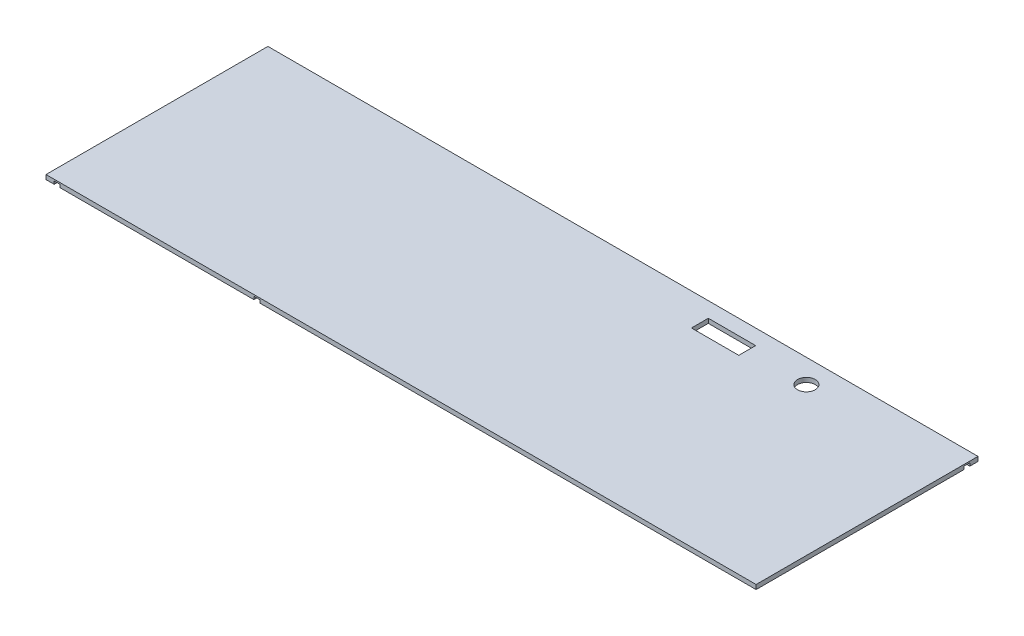
ISO-10303-21;
HEADER;
FILE_DESCRIPTION(('STEP AP214'),'2;1');
FILE_NAME('part.step','',(''),(''),'','','');
FILE_SCHEMA(('AUTOMOTIVE_DESIGN { 1 0 10303 214 1 1 1 1 }'));
ENDSEC;
DATA;
#1=APPLICATION_CONTEXT('core data for automotive mechanical design processes');
#2=APPLICATION_PROTOCOL_DEFINITION('international standard','automotive_design',2000,#1);
#3=PRODUCT_CONTEXT('',#1,'mechanical');
#4=PRODUCT('Part','Part','',(#3));
#5=PRODUCT_RELATED_PRODUCT_CATEGORY('part','',(#4));
#6=PRODUCT_DEFINITION_FORMATION('','',#4);
#7=PRODUCT_DEFINITION_CONTEXT('part definition',#1,'design');
#8=PRODUCT_DEFINITION('design','',#6,#7);
#9=PRODUCT_DEFINITION_SHAPE('','',#8);
#10=(LENGTH_UNIT() NAMED_UNIT(*) SI_UNIT(.MILLI.,.METRE.));
#11=(NAMED_UNIT(*) PLANE_ANGLE_UNIT() SI_UNIT($,.RADIAN.));
#12=(NAMED_UNIT(*) SI_UNIT($,.STERADIAN.) SOLID_ANGLE_UNIT());
#13=UNCERTAINTY_MEASURE_WITH_UNIT(LENGTH_MEASURE(1.E-05),#10,'distance_accuracy_value','');
#14=(GEOMETRIC_REPRESENTATION_CONTEXT(3) GLOBAL_UNCERTAINTY_ASSIGNED_CONTEXT((#13)) GLOBAL_UNIT_ASSIGNED_CONTEXT((#10,
#11,#12)) REPRESENTATION_CONTEXT('',''));
#15=CARTESIAN_POINT('',(0.,0.,0.));
#16=DIRECTION('',(0.,0.,1.));
#17=DIRECTION('',(1.,0.,0.));
#18=AXIS2_PLACEMENT_3D('',#15,#16,#17);
#19=CARTESIAN_POINT('',(0.,0.,0.));
#20=DIRECTION('',(0.,-1.,0.));
#21=DIRECTION('',(0.,0.,-1.));
#22=AXIS2_PLACEMENT_3D('',#19,#20,#21);
#23=PLANE('',#22);
#24=CARTESIAN_POINT('',(700.,0.,-295.));
#25=DIRECTION('',(0.,1.,0.));
#26=DIRECTION('',(0.,0.,1.));
#27=AXIS2_PLACEMENT_3D('',#24,#25,#26);
#28=CIRCLE('',#27,30.0000000000001);
#29=CARTESIAN_POINT('',(700.,0.,-265.));
#30=VERTEX_POINT('',#29);
#31=EDGE_CURVE('E400',#30,#30,#28,.T.);
#32=ORIENTED_EDGE('',*,*,#31,.T.);
#33=EDGE_LOOP('',(#32));
#34=FACE_BOUND('',#33,.T.);
#35=DIRECTION('',(1.,0.,0.));
#36=VECTOR('',#35,1.);
#37=CARTESIAN_POINT('',(500.,0.,-266.5));
#38=LINE('',#37,#36);
#39=CARTESIAN_POINT('',(340.,0.,-266.5));
#40=VERTEX_POINT('',#39);
#41=CARTESIAN_POINT('',(500.,0.,-266.5));
#42=VERTEX_POINT('',#41);
#43=EDGE_CURVE('E373',#40,#42,#38,.T.);
#44=ORIENTED_EDGE('',*,*,#43,.T.);
#45=DIRECTION('',(0.,0.,-1.));
#46=VECTOR('',#45,1.);
#47=CARTESIAN_POINT('',(500.,0.,-266.5));
#48=LINE('',#47,#46);
#49=CARTESIAN_POINT('',(500.,0.,-323.5));
#50=VERTEX_POINT('',#49);
#51=EDGE_CURVE('E336',#42,#50,#48,.T.);
#52=ORIENTED_EDGE('',*,*,#51,.T.);
#53=DIRECTION('',(-1.,0.,0.));
#54=VECTOR('',#53,1.);
#55=CARTESIAN_POINT('',(500.,0.,-323.5));
#56=LINE('',#55,#54);
#57=CARTESIAN_POINT('',(340.,0.,-323.5));
#58=VERTEX_POINT('',#57);
#59=EDGE_CURVE('E383',#50,#58,#56,.T.);
#60=ORIENTED_EDGE('',*,*,#59,.T.);
#61=DIRECTION('',(0.,0.,1.));
#62=VECTOR('',#61,1.);
#63=CARTESIAN_POINT('',(340.,0.,-266.5));
#64=LINE('',#63,#62);
#65=EDGE_CURVE('E386',#58,#40,#64,.T.);
#66=ORIENTED_EDGE('',*,*,#65,.T.);
#67=EDGE_LOOP('',(#44,#52,#60,#66));
#68=FACE_BOUND('',#67,.T.);
#69=DIRECTION('',(-1.,0.,0.));
#70=VECTOR('',#69,1.);
#71=CARTESIAN_POINT('',(-525.,0.,-327.5));
#72=LINE('',#71,#70);
#73=CARTESIAN_POINT('',(-525.,0.,-327.5));
#74=VERTEX_POINT('',#73);
#75=CARTESIAN_POINT('',(-1125.,0.,-327.5));
#76=VERTEX_POINT('',#75);
#77=EDGE_CURVE('E298',#74,#76,#72,.T.);
#78=ORIENTED_EDGE('',*,*,#77,.F.);
#79=DIRECTION('',(0.,0.,1.));
#80=VECTOR('',#79,1.);
#81=CARTESIAN_POINT('',(-525.,0.,0.));
#82=LINE('',#81,#80);
#83=CARTESIAN_POINT('',(-525.,0.,-347.5));
#84=VERTEX_POINT('',#83);
#85=EDGE_CURVE('E287',#84,#74,#82,.T.);
#86=ORIENTED_EDGE('',*,*,#85,.F.);
#87=DIRECTION('',(-1.,0.,0.));
#88=VECTOR('',#87,1.);
#89=CARTESIAN_POINT('',(-525.,0.,-347.5));
#90=LINE('',#89,#88);
#91=CARTESIAN_POINT('',(-1125.,0.,-347.5));
#92=VERTEX_POINT('',#91);
#93=EDGE_CURVE('E302',#84,#92,#90,.T.);
#94=ORIENTED_EDGE('',*,*,#93,.T.);
#95=DIRECTION('',(0.,0.,1.));
#96=VECTOR('',#95,1.);
#97=CARTESIAN_POINT('',(-1125.,0.,0.));
#98=LINE('',#97,#96);
#99=EDGE_CURVE('E283',#92,#76,#98,.T.);
#100=ORIENTED_EDGE('',*,*,#99,.T.);
#101=EDGE_LOOP('',(#78,#86,#94,#100));
#102=FACE_BOUND('',#101,.T.);
#103=DIRECTION('',(0.,0.,1.));
#104=VECTOR('',#103,1.);
#105=CARTESIAN_POINT('',(-450.,0.,0.));
#106=LINE('',#105,#104);
#107=CARTESIAN_POINT('',(-450.,0.,-347.5));
#108=VERTEX_POINT('',#107);
#109=CARTESIAN_POINT('',(-450.,0.,-327.5));
#110=VERTEX_POINT('',#109);
#111=EDGE_CURVE('E256',#108,#110,#106,.T.);
#112=ORIENTED_EDGE('',*,*,#111,.T.);
#113=DIRECTION('',(-1.,0.,0.));
#114=VECTOR('',#113,1.);
#115=CARTESIAN_POINT('',(1200.,0.,-327.5));
#116=LINE('',#115,#114);
#117=CARTESIAN_POINT('',(1200.,0.,-327.5));
#118=VERTEX_POINT('',#117);
#119=EDGE_CURVE('E271',#118,#110,#116,.T.);
#120=ORIENTED_EDGE('',*,*,#119,.F.);
#121=DIRECTION('',(0.,0.,-1.));
#122=VECTOR('',#121,1.);
#123=CARTESIAN_POINT('',(1200.,0.,375.));
#124=LINE('',#123,#122);
#125=CARTESIAN_POINT('',(1200.,0.,375.));
#126=VERTEX_POINT('',#125);
#127=EDGE_CURVE('E418',#126,#118,#124,.T.);
#128=ORIENTED_EDGE('',*,*,#127,.F.);
#129=DIRECTION('',(1.,0.,0.));
#130=VECTOR('',#129,1.);
#131=CARTESIAN_POINT('',(-1200.,0.,375.));
#132=LINE('',#131,#130);
#133=CARTESIAN_POINT('',(-477.5,0.,375.));
#134=VERTEX_POINT('',#133);
#135=EDGE_CURVE('E425',#134,#126,#132,.T.);
#136=ORIENTED_EDGE('',*,*,#135,.F.);
#137=DIRECTION('',(0.,0.,-1.));
#138=VECTOR('',#137,1.);
#139=CARTESIAN_POINT('',(-477.5,4.28669445619158E-12,375.));
#140=LINE('',#139,#138);
#141=CARTESIAN_POINT('',(-477.5,4.28669445619158E-12,-300.));
#142=VERTEX_POINT('',#141);
#143=EDGE_CURVE('E345',#134,#142,#140,.T.);
#144=ORIENTED_EDGE('',*,*,#143,.T.);
#145=DIRECTION('',(-1.,0.,0.));
#146=VECTOR('',#145,1.);
#147=CARTESIAN_POINT('',(-477.5,4.28669445619158E-12,-300.));
#148=LINE('',#147,#146);
#149=CARTESIAN_POINT('',(-497.5,4.0399782284971E-12,-300.));
#150=VERTEX_POINT('',#149);
#151=EDGE_CURVE('E354',#142,#150,#148,.T.);
#152=ORIENTED_EDGE('',*,*,#151,.T.);
#153=DIRECTION('',(0.,0.,-1.));
#154=VECTOR('',#153,1.);
#155=CARTESIAN_POINT('',(-497.5,4.0399782284971E-12,375.));
#156=LINE('',#155,#154);
#157=CARTESIAN_POINT('',(-497.5,4.0399782284971E-12,375.));
#158=VERTEX_POINT('',#157);
#159=EDGE_CURVE('E348',#158,#150,#156,.T.);
#160=ORIENTED_EDGE('',*,*,#159,.F.);
#161=CARTESIAN_POINT('',(-1152.5,0.,375.));
#162=VERTEX_POINT('',#161);
#163=EDGE_CURVE('E428',#162,#158,#132,.T.);
#164=ORIENTED_EDGE('',*,*,#163,.F.);
#165=DIRECTION('',(0.,0.,-1.));
#166=VECTOR('',#165,1.);
#167=CARTESIAN_POINT('',(-1152.5,0.,375.));
#168=LINE('',#167,#166);
#169=CARTESIAN_POINT('',(-1152.5,0.,-300.));
#170=VERTEX_POINT('',#169);
#171=EDGE_CURVE('E333',#162,#170,#168,.T.);
#172=ORIENTED_EDGE('',*,*,#171,.T.);
#173=DIRECTION('',(-1.,0.,0.));
#174=VECTOR('',#173,1.);
#175=CARTESIAN_POINT('',(-1172.5,0.,-300.));
#176=LINE('',#175,#174);
#177=CARTESIAN_POINT('',(-1172.5,0.,-300.));
#178=VERTEX_POINT('',#177);
#179=EDGE_CURVE('E321',#170,#178,#176,.T.);
#180=ORIENTED_EDGE('',*,*,#179,.T.);
#181=DIRECTION('',(0.,0.,-1.));
#182=VECTOR('',#181,1.);
#183=CARTESIAN_POINT('',(-1172.5,0.,375.));
#184=LINE('',#183,#182);
#185=CARTESIAN_POINT('',(-1172.5,0.,375.));
#186=VERTEX_POINT('',#185);
#187=EDGE_CURVE('E320',#186,#178,#184,.T.);
#188=ORIENTED_EDGE('',*,*,#187,.F.);
#189=CARTESIAN_POINT('',(-1200.,0.,375.));
#190=VERTEX_POINT('',#189);
#191=EDGE_CURVE('E411',#190,#186,#132,.T.);
#192=ORIENTED_EDGE('',*,*,#191,.F.);
#193=DIRECTION('',(0.,0.,1.));
#194=VECTOR('',#193,1.);
#195=CARTESIAN_POINT('',(-1200.,0.,375.));
#196=LINE('',#195,#194);
#197=CARTESIAN_POINT('',(-1200.,0.,-375.));
#198=VERTEX_POINT('',#197);
#199=EDGE_CURVE('E423',#198,#190,#196,.T.);
#200=ORIENTED_EDGE('',*,*,#199,.F.);
#201=DIRECTION('',(-1.,0.,0.));
#202=VECTOR('',#201,1.);
#203=CARTESIAN_POINT('',(-1200.,0.,-375.));
#204=LINE('',#203,#202);
#205=CARTESIAN_POINT('',(1200.,0.,-375.));
#206=VERTEX_POINT('',#205);
#207=EDGE_CURVE('E421',#206,#198,#204,.T.);
#208=ORIENTED_EDGE('',*,*,#207,.F.);
#209=CARTESIAN_POINT('',(1200.,0.,-347.5));
#210=VERTEX_POINT('',#209);
#211=EDGE_CURVE('E404',#210,#206,#124,.T.);
#212=ORIENTED_EDGE('',*,*,#211,.F.);
#213=DIRECTION('',(-1.,0.,0.));
#214=VECTOR('',#213,1.);
#215=CARTESIAN_POINT('',(1200.,0.,-347.5));
#216=LINE('',#215,#214);
#217=EDGE_CURVE('E274',#210,#108,#216,.T.);
#218=ORIENTED_EDGE('',*,*,#217,.T.);
#219=EDGE_LOOP('',(#112,#120,#128,#136,#144,#152,#160,#164,#172,#180,#188,#192,#200,#208,#212,#218));
#220=FACE_BOUND('',#219,.T.);
#221=DIRECTION('',(-1.,0.,0.));
#222=VECTOR('',#221,1.);
#223=CARTESIAN_POINT('',(800.,0.,347.5));
#224=LINE('',#223,#222);
#225=CARTESIAN_POINT('',(800.,0.,347.5));
#226=VERTEX_POINT('',#225);
#227=CARTESIAN_POINT('',(-450.,0.,347.5));
#228=VERTEX_POINT('',#227);
#229=EDGE_CURVE('E228',#226,#228,#224,.T.);
#230=ORIENTED_EDGE('',*,*,#229,.F.);
#231=DIRECTION('',(0.,0.,1.));
#232=VECTOR('',#231,1.);
#233=CARTESIAN_POINT('',(800.,0.,0.));
#234=LINE('',#233,#232);
#235=CARTESIAN_POINT('',(800.,0.,327.5));
#236=VERTEX_POINT('',#235);
#237=EDGE_CURVE('E235',#236,#226,#234,.T.);
#238=ORIENTED_EDGE('',*,*,#237,.F.);
#239=DIRECTION('',(-1.,0.,0.));
#240=VECTOR('',#239,1.);
#241=CARTESIAN_POINT('',(800.,0.,327.5));
#242=LINE('',#241,#240);
#243=CARTESIAN_POINT('',(-450.,0.,327.5));
#244=VERTEX_POINT('',#243);
#245=EDGE_CURVE('E265',#236,#244,#242,.T.);
#246=ORIENTED_EDGE('',*,*,#245,.T.);
#247=DIRECTION('',(0.,0.,1.));
#248=VECTOR('',#247,1.);
#249=CARTESIAN_POINT('',(-450.,0.,0.));
#250=LINE('',#249,#248);
#251=EDGE_CURVE('E246',#244,#228,#250,.T.);
#252=ORIENTED_EDGE('',*,*,#251,.T.);
#253=EDGE_LOOP('',(#230,#238,#246,#252));
#254=FACE_BOUND('',#253,.T.);
#255=ADVANCED_FACE('F38',(#34,#68,#102,#220,#254),#23,.T.);
#256=CARTESIAN_POINT('',(1200.,15.,375.));
#257=DIRECTION('',(-1.,0.,0.));
#258=DIRECTION('',(0.,0.,1.));
#259=AXIS2_PLACEMENT_3D('',#256,#257,#258);
#260=PLANE('',#259);
#261=DIRECTION('',(0.,-1.,0.));
#262=VECTOR('',#261,1.);
#263=CARTESIAN_POINT('',(1200.,0.,-327.5));
#264=LINE('',#263,#262);
#265=CARTESIAN_POINT('',(1200.,9.99999999999999,-327.5));
#266=VERTEX_POINT('',#265);
#267=EDGE_CURVE('E253',#266,#118,#264,.T.);
#268=ORIENTED_EDGE('',*,*,#267,.F.);
#269=DIRECTION('',(0.,0.,1.));
#270=VECTOR('',#269,1.);
#271=CARTESIAN_POINT('',(1200.,9.99999999999999,0.));
#272=LINE('',#271,#270);
#273=CARTESIAN_POINT('',(1200.,9.99999999999999,-347.5));
#274=VERTEX_POINT('',#273);
#275=EDGE_CURVE('E255',#274,#266,#272,.T.);
#276=ORIENTED_EDGE('',*,*,#275,.F.);
#277=DIRECTION('',(0.,1.,0.));
#278=VECTOR('',#277,1.);
#279=CARTESIAN_POINT('',(1200.,0.,-347.5));
#280=LINE('',#279,#278);
#281=EDGE_CURVE('E258',#210,#274,#280,.T.);
#282=ORIENTED_EDGE('',*,*,#281,.F.);
#283=ORIENTED_EDGE('',*,*,#211,.T.);
#284=DIRECTION('',(0.,-1.,0.));
#285=VECTOR('',#284,1.);
#286=CARTESIAN_POINT('',(1200.,15.,-375.));
#287=LINE('',#286,#285);
#288=CARTESIAN_POINT('',(1200.,15.,-375.));
#289=VERTEX_POINT('',#288);
#290=EDGE_CURVE('E11',#289,#206,#287,.T.);
#291=ORIENTED_EDGE('',*,*,#290,.F.);
#292=DIRECTION('',(0.,0.,-1.));
#293=VECTOR('',#292,1.);
#294=CARTESIAN_POINT('',(1200.,15.,375.));
#295=LINE('',#294,#293);
#296=CARTESIAN_POINT('',(1200.,15.,375.));
#297=VERTEX_POINT('',#296);
#298=EDGE_CURVE('E407',#297,#289,#295,.T.);
#299=ORIENTED_EDGE('',*,*,#298,.F.);
#300=DIRECTION('',(0.,-1.,0.));
#301=VECTOR('',#300,1.);
#302=CARTESIAN_POINT('',(1200.,15.,375.));
#303=LINE('',#302,#301);
#304=EDGE_CURVE('E417',#297,#126,#303,.T.);
#305=ORIENTED_EDGE('',*,*,#304,.T.);
#306=ORIENTED_EDGE('',*,*,#127,.T.);
#307=EDGE_LOOP('',(#268,#276,#282,#283,#291,#299,#305,#306));
#308=FACE_BOUND('',#307,.T.);
#309=ADVANCED_FACE('F40',(#308),#260,.F.);
#310=CARTESIAN_POINT('',(0.,15.,0.));
#311=DIRECTION('',(0.,-1.,0.));
#312=DIRECTION('',(0.,0.,-1.));
#313=AXIS2_PLACEMENT_3D('',#310,#311,#312);
#314=PLANE('',#313);
#315=CARTESIAN_POINT('',(700.,15.,-295.));
#316=DIRECTION('',(0.,1.,0.));
#317=DIRECTION('',(0.,0.,1.));
#318=AXIS2_PLACEMENT_3D('',#315,#316,#317);
#319=CIRCLE('',#318,30.0000000000001);
#320=CARTESIAN_POINT('',(700.,15.,-265.));
#321=VERTEX_POINT('',#320);
#322=EDGE_CURVE('E401',#321,#321,#319,.T.);
#323=ORIENTED_EDGE('',*,*,#322,.F.);
#324=EDGE_LOOP('',(#323));
#325=FACE_BOUND('',#324,.T.);
#326=ORIENTED_EDGE('',*,*,#298,.T.);
#327=DIRECTION('',(-1.,0.,0.));
#328=VECTOR('',#327,1.);
#329=CARTESIAN_POINT('',(-1200.,15.,-375.));
#330=LINE('',#329,#328);
#331=CARTESIAN_POINT('',(-1200.,15.,-375.));
#332=VERTEX_POINT('',#331);
#333=EDGE_CURVE('E410',#289,#332,#330,.T.);
#334=ORIENTED_EDGE('',*,*,#333,.T.);
#335=DIRECTION('',(0.,0.,1.));
#336=VECTOR('',#335,1.);
#337=CARTESIAN_POINT('',(-1200.,15.,375.));
#338=LINE('',#337,#336);
#339=CARTESIAN_POINT('',(-1200.,15.,375.));
#340=VERTEX_POINT('',#339);
#341=EDGE_CURVE('E413',#332,#340,#338,.T.);
#342=ORIENTED_EDGE('',*,*,#341,.T.);
#343=DIRECTION('',(1.,0.,0.));
#344=VECTOR('',#343,1.);
#345=CARTESIAN_POINT('',(-1200.,15.,375.));
#346=LINE('',#345,#344);
#347=EDGE_CURVE('E415',#340,#297,#346,.T.);
#348=ORIENTED_EDGE('',*,*,#347,.T.);
#349=EDGE_LOOP('',(#326,#334,#342,#348));
#350=FACE_BOUND('',#349,.T.);
#351=DIRECTION('',(0.,0.,-1.));
#352=VECTOR('',#351,1.);
#353=CARTESIAN_POINT('',(500.,15.,-266.5));
#354=LINE('',#353,#352);
#355=CARTESIAN_POINT('',(500.,15.,-266.5));
#356=VERTEX_POINT('',#355);
#357=CARTESIAN_POINT('',(500.,15.,-323.5));
#358=VERTEX_POINT('',#357);
#359=EDGE_CURVE('E370',#356,#358,#354,.T.);
#360=ORIENTED_EDGE('',*,*,#359,.F.);
#361=DIRECTION('',(1.,0.,0.));
#362=VECTOR('',#361,1.);
#363=CARTESIAN_POINT('',(500.,15.,-266.5));
#364=LINE('',#363,#362);
#365=CARTESIAN_POINT('',(340.,15.,-266.5));
#366=VERTEX_POINT('',#365);
#367=EDGE_CURVE('E378',#366,#356,#364,.T.);
#368=ORIENTED_EDGE('',*,*,#367,.F.);
#369=DIRECTION('',(0.,0.,1.));
#370=VECTOR('',#369,1.);
#371=CARTESIAN_POINT('',(340.,15.,-266.5));
#372=LINE('',#371,#370);
#373=CARTESIAN_POINT('',(340.,15.,-323.5));
#374=VERTEX_POINT('',#373);
#375=EDGE_CURVE('E375',#374,#366,#372,.T.);
#376=ORIENTED_EDGE('',*,*,#375,.F.);
#377=DIRECTION('',(-1.,0.,0.));
#378=VECTOR('',#377,1.);
#379=CARTESIAN_POINT('',(500.,15.,-323.5));
#380=LINE('',#379,#378);
#381=EDGE_CURVE('E372',#358,#374,#380,.T.);
#382=ORIENTED_EDGE('',*,*,#381,.F.);
#383=EDGE_LOOP('',(#360,#368,#376,#382));
#384=FACE_BOUND('',#383,.T.);
#385=ADVANCED_FACE('F452',(#325,#350,#384),#314,.F.);
#386=CARTESIAN_POINT('',(-1200.,15.,-375.));
#387=DIRECTION('',(0.,0.,1.));
#388=DIRECTION('',(1.,0.,0.));
#389=AXIS2_PLACEMENT_3D('',#386,#387,#388);
#390=PLANE('',#389);
#391=ORIENTED_EDGE('',*,*,#207,.T.);
#392=DIRECTION('',(0.,-1.,0.));
#393=VECTOR('',#392,1.);
#394=CARTESIAN_POINT('',(-1200.,15.,-375.));
#395=LINE('',#394,#393);
#396=EDGE_CURVE('E46',#332,#198,#395,.T.);
#397=ORIENTED_EDGE('',*,*,#396,.F.);
#398=ORIENTED_EDGE('',*,*,#333,.F.);
#399=ORIENTED_EDGE('',*,*,#290,.T.);
#400=EDGE_LOOP('',(#391,#397,#398,#399));
#401=FACE_BOUND('',#400,.T.);
#402=ADVANCED_FACE('F455',(#401),#390,.F.);
#403=CARTESIAN_POINT('',(-1200.,15.,375.));
#404=DIRECTION('',(1.,0.,0.));
#405=DIRECTION('',(0.,0.,-1.));
#406=AXIS2_PLACEMENT_3D('',#403,#404,#405);
#407=PLANE('',#406);
#408=ORIENTED_EDGE('',*,*,#199,.T.);
#409=DIRECTION('',(0.,-1.,0.));
#410=VECTOR('',#409,1.);
#411=CARTESIAN_POINT('',(-1200.,15.,375.));
#412=LINE('',#411,#410);
#413=EDGE_CURVE('E431',#340,#190,#412,.T.);
#414=ORIENTED_EDGE('',*,*,#413,.F.);
#415=ORIENTED_EDGE('',*,*,#341,.F.);
#416=ORIENTED_EDGE('',*,*,#396,.T.);
#417=EDGE_LOOP('',(#408,#414,#415,#416));
#418=FACE_BOUND('',#417,.T.);
#419=ADVANCED_FACE('F438',(#418),#407,.F.);
#420=CARTESIAN_POINT('',(-1200.,15.,375.));
#421=DIRECTION('',(0.,0.,-1.));
#422=DIRECTION('',(-1.,0.,0.));
#423=AXIS2_PLACEMENT_3D('',#420,#421,#422);
#424=PLANE('',#423);
#425=DIRECTION('',(1.,0.,0.));
#426=VECTOR('',#425,1.);
#427=CARTESIAN_POINT('',(-1152.5,10.,375.));
#428=LINE('',#427,#426);
#429=CARTESIAN_POINT('',(-1172.5,10.,375.));
#430=VERTEX_POINT('',#429);
#431=CARTESIAN_POINT('',(-1152.5,10.,375.));
#432=VERTEX_POINT('',#431);
#433=EDGE_CURVE('E313',#430,#432,#428,.T.);
#434=ORIENTED_EDGE('',*,*,#433,.T.);
#435=DIRECTION('',(0.,-1.,0.));
#436=VECTOR('',#435,1.);
#437=CARTESIAN_POINT('',(-1152.5,0.,375.));
#438=LINE('',#437,#436);
#439=EDGE_CURVE('E317',#432,#162,#438,.T.);
#440=ORIENTED_EDGE('',*,*,#439,.T.);
#441=ORIENTED_EDGE('',*,*,#163,.T.);
#442=DIRECTION('',(0.,1.,0.));
#443=VECTOR('',#442,1.);
#444=CARTESIAN_POINT('',(-497.5,4.0399782284971E-12,375.));
#445=LINE('',#444,#443);
#446=CARTESIAN_POINT('',(-497.5,10.000000000004,375.));
#447=VERTEX_POINT('',#446);
#448=EDGE_CURVE('E344',#158,#447,#445,.T.);
#449=ORIENTED_EDGE('',*,*,#448,.T.);
#450=DIRECTION('',(1.,0.,0.));
#451=VECTOR('',#450,1.);
#452=CARTESIAN_POINT('',(-497.5,10.000000000004,375.));
#453=LINE('',#452,#451);
#454=CARTESIAN_POINT('',(-477.5,10.0000000000043,375.));
#455=VERTEX_POINT('',#454);
#456=EDGE_CURVE('E355',#447,#455,#453,.T.);
#457=ORIENTED_EDGE('',*,*,#456,.T.);
#458=DIRECTION('',(0.,-1.,0.));
#459=VECTOR('',#458,1.);
#460=CARTESIAN_POINT('',(-477.5,10.0000000000043,375.));
#461=LINE('',#460,#459);
#462=EDGE_CURVE('E365',#455,#134,#461,.T.);
#463=ORIENTED_EDGE('',*,*,#462,.T.);
#464=ORIENTED_EDGE('',*,*,#135,.T.);
#465=ORIENTED_EDGE('',*,*,#304,.F.);
#466=ORIENTED_EDGE('',*,*,#347,.F.);
#467=ORIENTED_EDGE('',*,*,#413,.T.);
#468=ORIENTED_EDGE('',*,*,#191,.T.);
#469=DIRECTION('',(0.,1.,0.));
#470=VECTOR('',#469,1.);
#471=CARTESIAN_POINT('',(-1172.5,10.,375.));
#472=LINE('',#471,#470);
#473=EDGE_CURVE('E310',#186,#430,#472,.T.);
#474=ORIENTED_EDGE('',*,*,#473,.T.);
#475=EDGE_LOOP('',(#434,#440,#441,#449,#457,#463,#464,#465,#466,#467,#468,#474));
#476=FACE_BOUND('',#475,.T.);
#477=ADVANCED_FACE('F447',(#476),#424,.F.);
#478=CARTESIAN_POINT('',(700.,15.,-295.));
#479=DIRECTION('',(0.,-1.,0.));
#480=DIRECTION('',(0.,0.,-1.));
#481=AXIS2_PLACEMENT_3D('',#478,#479,#480);
#482=CYLINDRICAL_SURFACE('',#481,30.0000000000001);
#483=ORIENTED_EDGE('',*,*,#322,.T.);
#484=EDGE_LOOP('',(#483));
#485=FACE_BOUND('',#484,.T.);
#486=ORIENTED_EDGE('',*,*,#31,.F.);
#487=EDGE_LOOP('',(#486));
#488=FACE_BOUND('',#487,.T.);
#489=ADVANCED_FACE('F495',(#485,#488),#482,.F.);
#490=CARTESIAN_POINT('',(500.,15.,-266.5));
#491=DIRECTION('',(-1.,0.,0.));
#492=DIRECTION('',(0.,0.,1.));
#493=AXIS2_PLACEMENT_3D('',#490,#491,#492);
#494=PLANE('',#493);
#495=ORIENTED_EDGE('',*,*,#51,.F.);
#496=DIRECTION('',(0.,-1.,0.));
#497=VECTOR('',#496,1.);
#498=CARTESIAN_POINT('',(500.,15.,-266.5));
#499=LINE('',#498,#497);
#500=EDGE_CURVE('E380',#356,#42,#499,.T.);
#501=ORIENTED_EDGE('',*,*,#500,.F.);
#502=ORIENTED_EDGE('',*,*,#359,.T.);
#503=DIRECTION('',(0.,-1.,0.));
#504=VECTOR('',#503,1.);
#505=CARTESIAN_POINT('',(500.,15.,-323.5));
#506=LINE('',#505,#504);
#507=EDGE_CURVE('E397',#358,#50,#506,.T.);
#508=ORIENTED_EDGE('',*,*,#507,.T.);
#509=EDGE_LOOP('',(#495,#501,#502,#508));
#510=FACE_BOUND('',#509,.T.);
#511=ADVANCED_FACE('F508',(#510),#494,.T.);
#512=CARTESIAN_POINT('',(500.,15.,-323.5));
#513=DIRECTION('',(0.,0.,1.));
#514=DIRECTION('',(1.,0.,0.));
#515=AXIS2_PLACEMENT_3D('',#512,#513,#514);
#516=PLANE('',#515);
#517=ORIENTED_EDGE('',*,*,#59,.F.);
#518=ORIENTED_EDGE('',*,*,#507,.F.);
#519=ORIENTED_EDGE('',*,*,#381,.T.);
#520=DIRECTION('',(0.,-1.,0.));
#521=VECTOR('',#520,1.);
#522=CARTESIAN_POINT('',(340.,15.,-323.5));
#523=LINE('',#522,#521);
#524=EDGE_CURVE('E395',#374,#58,#523,.T.);
#525=ORIENTED_EDGE('',*,*,#524,.T.);
#526=EDGE_LOOP('',(#517,#518,#519,#525));
#527=FACE_BOUND('',#526,.T.);
#528=ADVANCED_FACE('F513',(#527),#516,.T.);
#529=CARTESIAN_POINT('',(340.,15.,-266.5));
#530=DIRECTION('',(1.,0.,0.));
#531=DIRECTION('',(0.,0.,-1.));
#532=AXIS2_PLACEMENT_3D('',#529,#530,#531);
#533=PLANE('',#532);
#534=ORIENTED_EDGE('',*,*,#65,.F.);
#535=ORIENTED_EDGE('',*,*,#524,.F.);
#536=ORIENTED_EDGE('',*,*,#375,.T.);
#537=DIRECTION('',(0.,-1.,0.));
#538=VECTOR('',#537,1.);
#539=CARTESIAN_POINT('',(340.,15.,-266.5));
#540=LINE('',#539,#538);
#541=EDGE_CURVE('E393',#366,#40,#540,.T.);
#542=ORIENTED_EDGE('',*,*,#541,.T.);
#543=EDGE_LOOP('',(#534,#535,#536,#542));
#544=FACE_BOUND('',#543,.T.);
#545=ADVANCED_FACE('F519',(#544),#533,.T.);
#546=CARTESIAN_POINT('',(500.,15.,-266.5));
#547=DIRECTION('',(0.,0.,-1.));
#548=DIRECTION('',(-1.,0.,0.));
#549=AXIS2_PLACEMENT_3D('',#546,#547,#548);
#550=PLANE('',#549);
#551=ORIENTED_EDGE('',*,*,#43,.F.);
#552=ORIENTED_EDGE('',*,*,#541,.F.);
#553=ORIENTED_EDGE('',*,*,#367,.T.);
#554=ORIENTED_EDGE('',*,*,#500,.T.);
#555=EDGE_LOOP('',(#551,#552,#553,#554));
#556=FACE_BOUND('',#555,.T.);
#557=ADVANCED_FACE('F523',(#556),#550,.T.);
#558=CARTESIAN_POINT('',(-497.5,10.000000000004,375.));
#559=DIRECTION('',(0.,1.,0.));
#560=DIRECTION('',(-1.,0.,0.));
#561=AXIS2_PLACEMENT_3D('',#558,#559,#560);
#562=PLANE('',#561);
#563=DIRECTION('',(1.,0.,0.));
#564=VECTOR('',#563,1.);
#565=CARTESIAN_POINT('',(-497.5,10.000000000004,-300.));
#566=LINE('',#565,#564);
#567=CARTESIAN_POINT('',(-497.5,10.000000000004,-300.));
#568=VERTEX_POINT('',#567);
#569=CARTESIAN_POINT('',(-477.5,10.0000000000043,-300.));
#570=VERTEX_POINT('',#569);
#571=EDGE_CURVE('E325',#568,#570,#566,.T.);
#572=ORIENTED_EDGE('',*,*,#571,.T.);
#573=DIRECTION('',(0.,0.,-1.));
#574=VECTOR('',#573,1.);
#575=CARTESIAN_POINT('',(-477.5,10.0000000000043,375.));
#576=LINE('',#575,#574);
#577=EDGE_CURVE('E342',#455,#570,#576,.T.);
#578=ORIENTED_EDGE('',*,*,#577,.F.);
#579=ORIENTED_EDGE('',*,*,#456,.F.);
#580=DIRECTION('',(0.,0.,-1.));
#581=VECTOR('',#580,1.);
#582=CARTESIAN_POINT('',(-497.5,10.000000000004,375.));
#583=LINE('',#582,#581);
#584=EDGE_CURVE('E301',#447,#568,#583,.T.);
#585=ORIENTED_EDGE('',*,*,#584,.T.);
#586=EDGE_LOOP('',(#572,#578,#579,#585));
#587=FACE_BOUND('',#586,.T.);
#588=ADVANCED_FACE('F527',(#587),#562,.F.);
#589=CARTESIAN_POINT('',(-497.5,4.0399782284971E-12,375.));
#590=DIRECTION('',(-1.,0.,0.));
#591=DIRECTION('',(0.,-1.,0.));
#592=AXIS2_PLACEMENT_3D('',#589,#590,#591);
#593=PLANE('',#592);
#594=DIRECTION('',(0.,1.,0.));
#595=VECTOR('',#594,1.);
#596=CARTESIAN_POINT('',(-497.5,4.0399782284971E-12,-300.));
#597=LINE('',#596,#595);
#598=EDGE_CURVE('E351',#150,#568,#597,.T.);
#599=ORIENTED_EDGE('',*,*,#598,.T.);
#600=ORIENTED_EDGE('',*,*,#584,.F.);
#601=ORIENTED_EDGE('',*,*,#448,.F.);
#602=ORIENTED_EDGE('',*,*,#159,.T.);
#603=EDGE_LOOP('',(#599,#600,#601,#602));
#604=FACE_BOUND('',#603,.T.);
#605=ADVANCED_FACE('F535',(#604),#593,.F.);
#606=CARTESIAN_POINT('',(-477.5,10.0000000000043,375.));
#607=DIRECTION('',(1.,0.,0.));
#608=DIRECTION('',(0.,1.,0.));
#609=AXIS2_PLACEMENT_3D('',#606,#607,#608);
#610=PLANE('',#609);
#611=DIRECTION('',(0.,-1.,0.));
#612=VECTOR('',#611,1.);
#613=CARTESIAN_POINT('',(-477.5,10.0000000000043,-300.));
#614=LINE('',#613,#612);
#615=EDGE_CURVE('E358',#570,#142,#614,.T.);
#616=ORIENTED_EDGE('',*,*,#615,.T.);
#617=ORIENTED_EDGE('',*,*,#143,.F.);
#618=ORIENTED_EDGE('',*,*,#462,.F.);
#619=ORIENTED_EDGE('',*,*,#577,.T.);
#620=EDGE_LOOP('',(#616,#617,#618,#619));
#621=FACE_BOUND('',#620,.T.);
#622=ADVANCED_FACE('F533',(#621),#610,.F.);
#623=CARTESIAN_POINT('',(0.,0.,-300.));
#624=DIRECTION('',(0.,0.,-1.));
#625=DIRECTION('',(-1.,0.,0.));
#626=AXIS2_PLACEMENT_3D('',#623,#624,#625);
#627=PLANE('',#626);
#628=ORIENTED_EDGE('',*,*,#571,.F.);
#629=ORIENTED_EDGE('',*,*,#598,.F.);
#630=ORIENTED_EDGE('',*,*,#151,.F.);
#631=ORIENTED_EDGE('',*,*,#615,.F.);
#632=EDGE_LOOP('',(#628,#629,#630,#631));
#633=FACE_BOUND('',#632,.T.);
#634=ADVANCED_FACE('F529',(#633),#627,.F.);
#635=CARTESIAN_POINT('',(-1152.5,0.,375.));
#636=DIRECTION('',(1.,0.,0.));
#637=DIRECTION('',(0.,0.,-1.));
#638=AXIS2_PLACEMENT_3D('',#635,#636,#637);
#639=PLANE('',#638);
#640=DIRECTION('',(0.,-1.,0.));
#641=VECTOR('',#640,1.);
#642=CARTESIAN_POINT('',(-1152.5,0.,-300.));
#643=LINE('',#642,#641);
#644=CARTESIAN_POINT('',(-1152.5,10.,-300.));
#645=VERTEX_POINT('',#644);
#646=EDGE_CURVE('E314',#645,#170,#643,.T.);
#647=ORIENTED_EDGE('',*,*,#646,.T.);
#648=ORIENTED_EDGE('',*,*,#171,.F.);
#649=ORIENTED_EDGE('',*,*,#439,.F.);
#650=DIRECTION('',(0.,0.,-1.));
#651=VECTOR('',#650,1.);
#652=CARTESIAN_POINT('',(-1152.5,10.,375.));
#653=LINE('',#652,#651);
#654=EDGE_CURVE('E337',#432,#645,#653,.T.);
#655=ORIENTED_EDGE('',*,*,#654,.T.);
#656=EDGE_LOOP('',(#647,#648,#649,#655));
#657=FACE_BOUND('',#656,.T.);
#658=ADVANCED_FACE('F532',(#657),#639,.F.);
#659=CARTESIAN_POINT('',(-1152.5,10.,375.));
#660=DIRECTION('',(0.,1.,0.));
#661=DIRECTION('',(0.,0.,1.));
#662=AXIS2_PLACEMENT_3D('',#659,#660,#661);
#663=PLANE('',#662);
#664=DIRECTION('',(1.,0.,0.));
#665=VECTOR('',#664,1.);
#666=CARTESIAN_POINT('',(-1152.5,10.,-300.));
#667=LINE('',#666,#665);
#668=CARTESIAN_POINT('',(-1172.5,10.,-300.));
#669=VERTEX_POINT('',#668);
#670=EDGE_CURVE('E328',#669,#645,#667,.T.);
#671=ORIENTED_EDGE('',*,*,#670,.T.);
#672=ORIENTED_EDGE('',*,*,#654,.F.);
#673=ORIENTED_EDGE('',*,*,#433,.F.);
#674=DIRECTION('',(0.,0.,-1.));
#675=VECTOR('',#674,1.);
#676=CARTESIAN_POINT('',(-1172.5,10.,375.));
#677=LINE('',#676,#675);
#678=EDGE_CURVE('E339',#430,#669,#677,.T.);
#679=ORIENTED_EDGE('',*,*,#678,.T.);
#680=EDGE_LOOP('',(#671,#672,#673,#679));
#681=FACE_BOUND('',#680,.T.);
#682=ADVANCED_FACE('F549',(#681),#663,.F.);
#683=CARTESIAN_POINT('',(-1172.5,10.,375.));
#684=DIRECTION('',(-1.,0.,0.));
#685=DIRECTION('',(0.,0.,1.));
#686=AXIS2_PLACEMENT_3D('',#683,#684,#685);
#687=PLANE('',#686);
#688=DIRECTION('',(0.,1.,0.));
#689=VECTOR('',#688,1.);
#690=CARTESIAN_POINT('',(-1172.5,10.,-300.));
#691=LINE('',#690,#689);
#692=EDGE_CURVE('E324',#178,#669,#691,.T.);
#693=ORIENTED_EDGE('',*,*,#692,.T.);
#694=ORIENTED_EDGE('',*,*,#678,.F.);
#695=ORIENTED_EDGE('',*,*,#473,.F.);
#696=ORIENTED_EDGE('',*,*,#187,.T.);
#697=EDGE_LOOP('',(#693,#694,#695,#696));
#698=FACE_BOUND('',#697,.T.);
#699=ADVANCED_FACE('F545',(#698),#687,.F.);
#700=CARTESIAN_POINT('',(0.,0.,-300.));
#701=DIRECTION('',(0.,0.,1.));
#702=DIRECTION('',(1.,0.,0.));
#703=AXIS2_PLACEMENT_3D('',#700,#701,#702);
#704=PLANE('',#703);
#705=ORIENTED_EDGE('',*,*,#179,.F.);
#706=ORIENTED_EDGE('',*,*,#646,.F.);
#707=ORIENTED_EDGE('',*,*,#670,.F.);
#708=ORIENTED_EDGE('',*,*,#692,.F.);
#709=EDGE_LOOP('',(#705,#706,#707,#708));
#710=FACE_BOUND('',#709,.T.);
#711=ADVANCED_FACE('F548',(#710),#704,.T.);
#712=CARTESIAN_POINT('',(-525.,0.,-327.5));
#713=DIRECTION('',(0.,0.,-1.));
#714=DIRECTION('',(-1.,0.,0.));
#715=AXIS2_PLACEMENT_3D('',#712,#713,#714);
#716=PLANE('',#715);
#717=DIRECTION('',(0.,-1.,0.));
#718=VECTOR('',#717,1.);
#719=CARTESIAN_POINT('',(-1125.,0.,-327.5));
#720=LINE('',#719,#718);
#721=CARTESIAN_POINT('',(-1125.,9.99999999999999,-327.5));
#722=VERTEX_POINT('',#721);
#723=EDGE_CURVE('E273',#722,#76,#720,.T.);
#724=ORIENTED_EDGE('',*,*,#723,.F.);
#725=DIRECTION('',(-1.,0.,0.));
#726=VECTOR('',#725,1.);
#727=CARTESIAN_POINT('',(-525.,9.99999999999999,-327.5));
#728=LINE('',#727,#726);
#729=CARTESIAN_POINT('',(-525.,9.99999999999999,-327.5));
#730=VERTEX_POINT('',#729);
#731=EDGE_CURVE('E290',#730,#722,#728,.T.);
#732=ORIENTED_EDGE('',*,*,#731,.F.);
#733=DIRECTION('',(0.,-1.,0.));
#734=VECTOR('',#733,1.);
#735=CARTESIAN_POINT('',(-525.,0.,-327.5));
#736=LINE('',#735,#734);
#737=EDGE_CURVE('E280',#730,#74,#736,.T.);
#738=ORIENTED_EDGE('',*,*,#737,.T.);
#739=ORIENTED_EDGE('',*,*,#77,.T.);
#740=EDGE_LOOP('',(#724,#732,#738,#739));
#741=FACE_BOUND('',#740,.T.);
#742=ADVANCED_FACE('F559',(#741),#716,.T.);
#743=CARTESIAN_POINT('',(-525.,0.,-347.5));
#744=DIRECTION('',(0.,0.,1.));
#745=DIRECTION('',(1.,0.,0.));
#746=AXIS2_PLACEMENT_3D('',#743,#744,#745);
#747=PLANE('',#746);
#748=DIRECTION('',(0.,1.,0.));
#749=VECTOR('',#748,1.);
#750=CARTESIAN_POINT('',(-1125.,0.,-347.5));
#751=LINE('',#750,#749);
#752=CARTESIAN_POINT('',(-1125.,9.99999999999999,-347.5));
#753=VERTEX_POINT('',#752);
#754=EDGE_CURVE('E294',#92,#753,#751,.T.);
#755=ORIENTED_EDGE('',*,*,#754,.F.);
#756=ORIENTED_EDGE('',*,*,#93,.F.);
#757=DIRECTION('',(0.,1.,0.));
#758=VECTOR('',#757,1.);
#759=CARTESIAN_POINT('',(-525.,0.,-347.5));
#760=LINE('',#759,#758);
#761=CARTESIAN_POINT('',(-525.,9.99999999999999,-347.5));
#762=VERTEX_POINT('',#761);
#763=EDGE_CURVE('E285',#84,#762,#760,.T.);
#764=ORIENTED_EDGE('',*,*,#763,.T.);
#765=DIRECTION('',(-1.,0.,0.));
#766=VECTOR('',#765,1.);
#767=CARTESIAN_POINT('',(-525.,9.99999999999999,-347.5));
#768=LINE('',#767,#766);
#769=EDGE_CURVE('E305',#762,#753,#768,.T.);
#770=ORIENTED_EDGE('',*,*,#769,.T.);
#771=EDGE_LOOP('',(#755,#756,#764,#770));
#772=FACE_BOUND('',#771,.T.);
#773=ADVANCED_FACE('F563',(#772),#747,.T.);
#774=CARTESIAN_POINT('',(-525.,9.99999999999999,0.));
#775=DIRECTION('',(0.,-1.,0.));
#776=DIRECTION('',(0.,0.,-1.));
#777=AXIS2_PLACEMENT_3D('',#774,#775,#776);
#778=PLANE('',#777);
#779=DIRECTION('',(0.,0.,1.));
#780=VECTOR('',#779,1.);
#781=CARTESIAN_POINT('',(-1125.,9.99999999999999,0.));
#782=LINE('',#781,#780);
#783=EDGE_CURVE('E292',#753,#722,#782,.T.);
#784=ORIENTED_EDGE('',*,*,#783,.F.);
#785=ORIENTED_EDGE('',*,*,#769,.F.);
#786=DIRECTION('',(0.,0.,1.));
#787=VECTOR('',#786,1.);
#788=CARTESIAN_POINT('',(-525.,9.99999999999999,0.));
#789=LINE('',#788,#787);
#790=EDGE_CURVE('E282',#762,#730,#789,.T.);
#791=ORIENTED_EDGE('',*,*,#790,.T.);
#792=ORIENTED_EDGE('',*,*,#731,.T.);
#793=EDGE_LOOP('',(#784,#785,#791,#792));
#794=FACE_BOUND('',#793,.T.);
#795=ADVANCED_FACE('F565',(#794),#778,.T.);
#796=CARTESIAN_POINT('',(-525.,0.,0.));
#797=DIRECTION('',(-1.,0.,0.));
#798=DIRECTION('',(0.,0.,1.));
#799=AXIS2_PLACEMENT_3D('',#796,#797,#798);
#800=PLANE('',#799);
#801=ORIENTED_EDGE('',*,*,#737,.F.);
#802=ORIENTED_EDGE('',*,*,#790,.F.);
#803=ORIENTED_EDGE('',*,*,#763,.F.);
#804=ORIENTED_EDGE('',*,*,#85,.T.);
#805=EDGE_LOOP('',(#801,#802,#803,#804));
#806=FACE_BOUND('',#805,.T.);
#807=ADVANCED_FACE('F568',(#806),#800,.T.);
#808=CARTESIAN_POINT('',(-1125.,0.,0.));
#809=DIRECTION('',(-1.,0.,0.));
#810=DIRECTION('',(0.,0.,1.));
#811=AXIS2_PLACEMENT_3D('',#808,#809,#810);
#812=PLANE('',#811);
#813=ORIENTED_EDGE('',*,*,#723,.T.);
#814=ORIENTED_EDGE('',*,*,#99,.F.);
#815=ORIENTED_EDGE('',*,*,#754,.T.);
#816=ORIENTED_EDGE('',*,*,#783,.T.);
#817=EDGE_LOOP('',(#813,#814,#815,#816));
#818=FACE_BOUND('',#817,.T.);
#819=ADVANCED_FACE('F573',(#818),#812,.F.);
#820=CARTESIAN_POINT('',(1200.,0.,-327.5));
#821=DIRECTION('',(0.,0.,-1.));
#822=DIRECTION('',(-1.,0.,0.));
#823=AXIS2_PLACEMENT_3D('',#820,#821,#822);
#824=PLANE('',#823);
#825=DIRECTION('',(0.,-1.,0.));
#826=VECTOR('',#825,1.);
#827=CARTESIAN_POINT('',(-450.,0.,-327.5));
#828=LINE('',#827,#826);
#829=CARTESIAN_POINT('',(-450.,9.99999999999999,-327.5));
#830=VERTEX_POINT('',#829);
#831=EDGE_CURVE('E261',#830,#110,#828,.T.);
#832=ORIENTED_EDGE('',*,*,#831,.F.);
#833=DIRECTION('',(-1.,0.,0.));
#834=VECTOR('',#833,1.);
#835=CARTESIAN_POINT('',(1200.,9.99999999999999,-327.5));
#836=LINE('',#835,#834);
#837=EDGE_CURVE('E260',#266,#830,#836,.T.);
#838=ORIENTED_EDGE('',*,*,#837,.F.);
#839=ORIENTED_EDGE('',*,*,#267,.T.);
#840=ORIENTED_EDGE('',*,*,#119,.T.);
#841=EDGE_LOOP('',(#832,#838,#839,#840));
#842=FACE_BOUND('',#841,.T.);
#843=ADVANCED_FACE('F469',(#842),#824,.T.);
#844=CARTESIAN_POINT('',(1200.,0.,-347.5));
#845=DIRECTION('',(0.,0.,1.));
#846=DIRECTION('',(1.,0.,0.));
#847=AXIS2_PLACEMENT_3D('',#844,#845,#846);
#848=PLANE('',#847);
#849=DIRECTION('',(0.,1.,0.));
#850=VECTOR('',#849,1.);
#851=CARTESIAN_POINT('',(-450.,0.,-347.5));
#852=LINE('',#851,#850);
#853=CARTESIAN_POINT('',(-450.,9.99999999999999,-347.5));
#854=VERTEX_POINT('',#853);
#855=EDGE_CURVE('E267',#108,#854,#852,.T.);
#856=ORIENTED_EDGE('',*,*,#855,.F.);
#857=ORIENTED_EDGE('',*,*,#217,.F.);
#858=ORIENTED_EDGE('',*,*,#281,.T.);
#859=DIRECTION('',(-1.,0.,0.));
#860=VECTOR('',#859,1.);
#861=CARTESIAN_POINT('',(1200.,9.99999999999999,-347.5));
#862=LINE('',#861,#860);
#863=EDGE_CURVE('E61',#274,#854,#862,.T.);
#864=ORIENTED_EDGE('',*,*,#863,.T.);
#865=EDGE_LOOP('',(#856,#857,#858,#864));
#866=FACE_BOUND('',#865,.T.);
#867=ADVANCED_FACE('F463',(#866),#848,.T.);
#868=CARTESIAN_POINT('',(1200.,9.99999999999999,0.));
#869=DIRECTION('',(0.,-1.,0.));
#870=DIRECTION('',(0.,0.,-1.));
#871=AXIS2_PLACEMENT_3D('',#868,#869,#870);
#872=PLANE('',#871);
#873=DIRECTION('',(0.,0.,1.));
#874=VECTOR('',#873,1.);
#875=CARTESIAN_POINT('',(-450.,9.99999999999999,0.));
#876=LINE('',#875,#874);
#877=EDGE_CURVE('E264',#854,#830,#876,.T.);
#878=ORIENTED_EDGE('',*,*,#877,.F.);
#879=ORIENTED_EDGE('',*,*,#863,.F.);
#880=ORIENTED_EDGE('',*,*,#275,.T.);
#881=ORIENTED_EDGE('',*,*,#837,.T.);
#882=EDGE_LOOP('',(#878,#879,#880,#881));
#883=FACE_BOUND('',#882,.T.);
#884=ADVANCED_FACE('F472',(#883),#872,.T.);
#885=CARTESIAN_POINT('',(-450.,0.,0.));
#886=DIRECTION('',(-1.,0.,0.));
#887=DIRECTION('',(0.,0.,1.));
#888=AXIS2_PLACEMENT_3D('',#885,#886,#887);
#889=PLANE('',#888);
#890=ORIENTED_EDGE('',*,*,#831,.T.);
#891=ORIENTED_EDGE('',*,*,#111,.F.);
#892=ORIENTED_EDGE('',*,*,#855,.T.);
#893=ORIENTED_EDGE('',*,*,#877,.T.);
#894=EDGE_LOOP('',(#890,#891,#892,#893));
#895=FACE_BOUND('',#894,.T.);
#896=ADVANCED_FACE('F465',(#895),#889,.F.);
#897=CARTESIAN_POINT('',(800.,0.,327.5));
#898=DIRECTION('',(0.,0.,-1.));
#899=DIRECTION('',(-1.,0.,0.));
#900=AXIS2_PLACEMENT_3D('',#897,#898,#899);
#901=PLANE('',#900);
#902=DIRECTION('',(0.,-1.,0.));
#903=VECTOR('',#902,1.);
#904=CARTESIAN_POINT('',(-450.,0.,327.5));
#905=LINE('',#904,#903);
#906=CARTESIAN_POINT('',(-450.,9.99999999999999,327.5));
#907=VERTEX_POINT('',#906);
#908=EDGE_CURVE('E244',#907,#244,#905,.T.);
#909=ORIENTED_EDGE('',*,*,#908,.T.);
#910=ORIENTED_EDGE('',*,*,#245,.F.);
#911=DIRECTION('',(0.,-1.,0.));
#912=VECTOR('',#911,1.);
#913=CARTESIAN_POINT('',(800.,0.,327.5));
#914=LINE('',#913,#912);
#915=CARTESIAN_POINT('',(800.,9.99999999999999,327.5));
#916=VERTEX_POINT('',#915);
#917=EDGE_CURVE('E241',#916,#236,#914,.T.);
#918=ORIENTED_EDGE('',*,*,#917,.F.);
#919=DIRECTION('',(-1.,0.,0.));
#920=VECTOR('',#919,1.);
#921=CARTESIAN_POINT('',(800.,9.99999999999999,327.5));
#922=LINE('',#921,#920);
#923=EDGE_CURVE('E248',#916,#907,#922,.T.);
#924=ORIENTED_EDGE('',*,*,#923,.T.);
#925=EDGE_LOOP('',(#909,#910,#918,#924));
#926=FACE_BOUND('',#925,.T.);
#927=ADVANCED_FACE('F479',(#926),#901,.F.);
#928=CARTESIAN_POINT('',(800.,9.99999999999999,0.));
#929=DIRECTION('',(0.,1.,0.));
#930=DIRECTION('',(0.,0.,1.));
#931=AXIS2_PLACEMENT_3D('',#928,#929,#930);
#932=PLANE('',#931);
#933=DIRECTION('',(0.,0.,-1.));
#934=VECTOR('',#933,1.);
#935=CARTESIAN_POINT('',(-450.,9.99999999999999,0.));
#936=LINE('',#935,#934);
#937=CARTESIAN_POINT('',(-450.,9.99999999999999,347.5));
#938=VERTEX_POINT('',#937);
#939=EDGE_CURVE('E668',#938,#907,#936,.T.);
#940=ORIENTED_EDGE('',*,*,#939,.T.);
#941=ORIENTED_EDGE('',*,*,#923,.F.);
#942=DIRECTION('',(0.,0.,-1.));
#943=VECTOR('',#942,1.);
#944=CARTESIAN_POINT('',(800.,9.99999999999999,0.));
#945=LINE('',#944,#943);
#946=CARTESIAN_POINT('',(800.,9.99999999999999,347.5));
#947=VERTEX_POINT('',#946);
#948=EDGE_CURVE('E234',#947,#916,#945,.T.);
#949=ORIENTED_EDGE('',*,*,#948,.F.);
#950=DIRECTION('',(-1.,0.,0.));
#951=VECTOR('',#950,1.);
#952=CARTESIAN_POINT('',(800.,9.99999999999999,347.5));
#953=LINE('',#952,#951);
#954=EDGE_CURVE('E230',#947,#938,#953,.T.);
#955=ORIENTED_EDGE('',*,*,#954,.T.);
#956=EDGE_LOOP('',(#940,#941,#949,#955));
#957=FACE_BOUND('',#956,.T.);
#958=ADVANCED_FACE('F616',(#957),#932,.F.);
#959=CARTESIAN_POINT('',(800.,0.,347.5));
#960=DIRECTION('',(0.,0.,1.));
#961=DIRECTION('',(1.,0.,0.));
#962=AXIS2_PLACEMENT_3D('',#959,#960,#961);
#963=PLANE('',#962);
#964=DIRECTION('',(0.,1.,0.));
#965=VECTOR('',#964,1.);
#966=CARTESIAN_POINT('',(-450.,0.,347.5));
#967=LINE('',#966,#965);
#968=EDGE_CURVE('E53',#228,#938,#967,.T.);
#969=ORIENTED_EDGE('',*,*,#968,.T.);
#970=ORIENTED_EDGE('',*,*,#954,.F.);
#971=DIRECTION('',(0.,1.,0.));
#972=VECTOR('',#971,1.);
#973=CARTESIAN_POINT('',(800.,0.,347.5));
#974=LINE('',#973,#972);
#975=EDGE_CURVE('E224',#226,#947,#974,.T.);
#976=ORIENTED_EDGE('',*,*,#975,.F.);
#977=ORIENTED_EDGE('',*,*,#229,.T.);
#978=EDGE_LOOP('',(#969,#970,#976,#977));
#979=FACE_BOUND('',#978,.T.);
#980=ADVANCED_FACE('F226',(#979),#963,.F.);
#981=CARTESIAN_POINT('',(800.,0.,0.));
#982=DIRECTION('',(-1.,0.,0.));
#983=DIRECTION('',(0.,0.,1.));
#984=AXIS2_PLACEMENT_3D('',#981,#982,#983);
#985=PLANE('',#984);
#986=ORIENTED_EDGE('',*,*,#237,.T.);
#987=ORIENTED_EDGE('',*,*,#975,.T.);
#988=ORIENTED_EDGE('',*,*,#948,.T.);
#989=ORIENTED_EDGE('',*,*,#917,.T.);
#990=EDGE_LOOP('',(#986,#987,#988,#989));
#991=FACE_BOUND('',#990,.T.);
#992=ADVANCED_FACE('F239',(#991),#985,.T.);
#993=CARTESIAN_POINT('',(-450.,0.,0.));
#994=DIRECTION('',(-1.,0.,0.));
#995=DIRECTION('',(0.,0.,1.));
#996=AXIS2_PLACEMENT_3D('',#993,#994,#995);
#997=PLANE('',#996);
#998=ORIENTED_EDGE('',*,*,#251,.F.);
#999=ORIENTED_EDGE('',*,*,#908,.F.);
#1000=ORIENTED_EDGE('',*,*,#939,.F.);
#1001=ORIENTED_EDGE('',*,*,#968,.F.);
#1002=EDGE_LOOP('',(#998,#999,#1000,#1001));
#1003=FACE_BOUND('',#1002,.T.);
#1004=ADVANCED_FACE('F645',(#1003),#997,.F.);
#1005=CLOSED_SHELL('',(#255,#309,#385,#402,#419,#477,#489,#511,#528,#545,#557,#588,#605,#622,
#634,#658,#682,#699,#711,#742,#773,#795,#807,#819,#843,#867,#884,#896,#927,#958,#980,#992,#1004));
#1006=MANIFOLD_SOLID_BREP('B2',#1005);
#1007=ADVANCED_BREP_SHAPE_REPRESENTATION('',(#18,#1006),#14);
#1008=SHAPE_DEFINITION_REPRESENTATION(#9,#1007);
ENDSEC;
END-ISO-10303-21;
